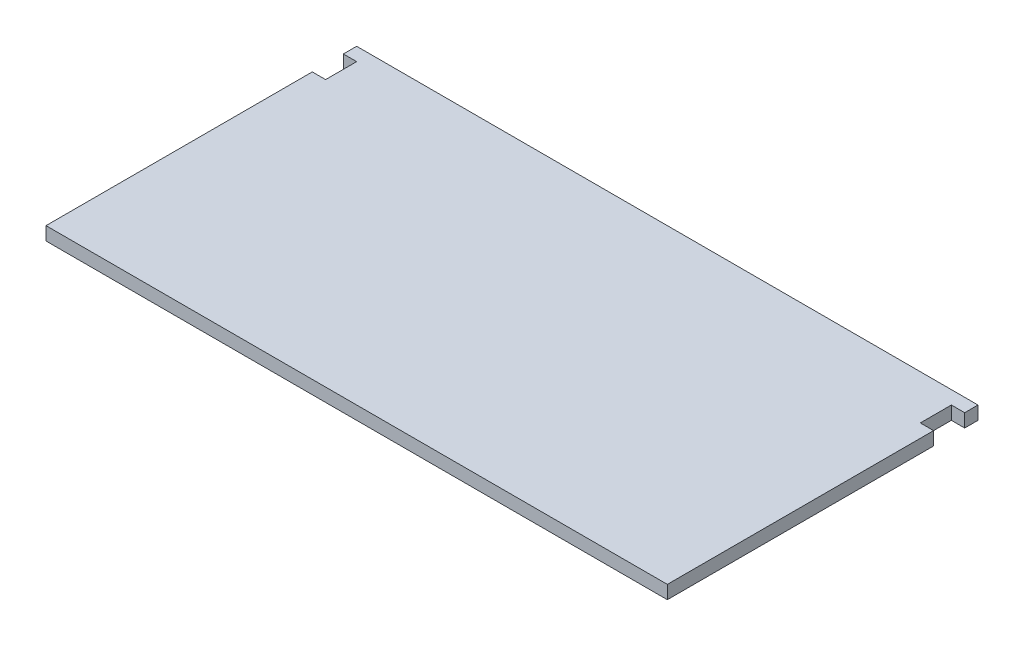
ISO-10303-21;
HEADER;
FILE_DESCRIPTION(('STEP AP214'),'2;1');
FILE_NAME('part.step','',(''),(''),'','','');
FILE_SCHEMA(('AUTOMOTIVE_DESIGN { 1 0 10303 214 1 1 1 1 }'));
ENDSEC;
DATA;
#1=APPLICATION_CONTEXT('core data for automotive mechanical design processes');
#2=APPLICATION_PROTOCOL_DEFINITION('international standard','automotive_design',2000,#1);
#3=PRODUCT_CONTEXT('',#1,'mechanical');
#4=PRODUCT('Part','Part','',(#3));
#5=PRODUCT_RELATED_PRODUCT_CATEGORY('part','',(#4));
#6=PRODUCT_DEFINITION_FORMATION('','',#4);
#7=PRODUCT_DEFINITION_CONTEXT('part definition',#1,'design');
#8=PRODUCT_DEFINITION('design','',#6,#7);
#9=PRODUCT_DEFINITION_SHAPE('','',#8);
#10=(LENGTH_UNIT() NAMED_UNIT(*) SI_UNIT(.MILLI.,.METRE.));
#11=(NAMED_UNIT(*) PLANE_ANGLE_UNIT() SI_UNIT($,.RADIAN.));
#12=(NAMED_UNIT(*) SI_UNIT($,.STERADIAN.) SOLID_ANGLE_UNIT());
#13=UNCERTAINTY_MEASURE_WITH_UNIT(LENGTH_MEASURE(1.E-05),#10,'distance_accuracy_value','');
#14=(GEOMETRIC_REPRESENTATION_CONTEXT(3) GLOBAL_UNCERTAINTY_ASSIGNED_CONTEXT((#13)) GLOBAL_UNIT_ASSIGNED_CONTEXT((#10,
#11,#12)) REPRESENTATION_CONTEXT('',''));
#15=CARTESIAN_POINT('',(0.,0.,0.));
#16=DIRECTION('',(0.,0.,1.));
#17=DIRECTION('',(1.,0.,0.));
#18=AXIS2_PLACEMENT_3D('',#15,#16,#17);
#19=CARTESIAN_POINT('',(70.,3.,35.));
#20=DIRECTION('',(-1.,0.,0.));
#21=DIRECTION('',(0.,0.,1.));
#22=AXIS2_PLACEMENT_3D('',#19,#20,#21);
#23=PLANE('',#22);
#24=DIRECTION('',(0.,0.,-1.));
#25=VECTOR('',#24,1.);
#26=CARTESIAN_POINT('',(70.,3.,35.));
#27=LINE('',#26,#25);
#28=CARTESIAN_POINT('',(70.,3.,-32.));
#29=VERTEX_POINT('',#28);
#30=CARTESIAN_POINT('',(70.,3.,-35.));
#31=VERTEX_POINT('',#30);
#32=EDGE_CURVE('E159',#29,#31,#27,.T.);
#33=ORIENTED_EDGE('',*,*,#32,.F.);
#34=DIRECTION('',(0.,1.,0.));
#35=VECTOR('',#34,1.);
#36=CARTESIAN_POINT('',(70.,0.,-32.));
#37=LINE('',#36,#35);
#38=CARTESIAN_POINT('',(70.,0.,-32.));
#39=VERTEX_POINT('',#38);
#40=EDGE_CURVE('E214',#39,#29,#37,.T.);
#41=ORIENTED_EDGE('',*,*,#40,.F.);
#42=DIRECTION('',(0.,0.,-1.));
#43=VECTOR('',#42,1.);
#44=CARTESIAN_POINT('',(70.,0.,35.));
#45=LINE('',#44,#43);
#46=CARTESIAN_POINT('',(70.,0.,-35.));
#47=VERTEX_POINT('',#46);
#48=EDGE_CURVE('E192',#39,#47,#45,.T.);
#49=ORIENTED_EDGE('',*,*,#48,.T.);
#50=DIRECTION('',(0.,-1.,0.));
#51=VECTOR('',#50,1.);
#52=CARTESIAN_POINT('',(70.,3.,-35.));
#53=LINE('',#52,#51);
#54=EDGE_CURVE('E11',#31,#47,#53,.T.);
#55=ORIENTED_EDGE('',*,*,#54,.F.);
#56=EDGE_LOOP('',(#33,#41,#49,#55));
#57=FACE_BOUND('',#56,.T.);
#58=ADVANCED_FACE('F36',(#57),#23,.F.);
#59=CARTESIAN_POINT('',(-70.,3.,35.));
#60=DIRECTION('',(1.,0.,0.));
#61=DIRECTION('',(0.,0.,-1.));
#62=AXIS2_PLACEMENT_3D('',#59,#60,#61);
#63=PLANE('',#62);
#64=DIRECTION('',(0.,0.,1.));
#65=VECTOR('',#64,1.);
#66=CARTESIAN_POINT('',(-70.,0.,35.));
#67=LINE('',#66,#65);
#68=CARTESIAN_POINT('',(-70.,0.,-35.));
#69=VERTEX_POINT('',#68);
#70=CARTESIAN_POINT('',(-70.,0.,-32.));
#71=VERTEX_POINT('',#70);
#72=EDGE_CURVE('E150',#69,#71,#67,.T.);
#73=ORIENTED_EDGE('',*,*,#72,.T.);
#74=DIRECTION('',(0.,1.,0.));
#75=VECTOR('',#74,1.);
#76=CARTESIAN_POINT('',(-70.,0.,-32.));
#77=LINE('',#76,#75);
#78=CARTESIAN_POINT('',(-70.,3.,-32.));
#79=VERTEX_POINT('',#78);
#80=EDGE_CURVE('E190',#71,#79,#77,.T.);
#81=ORIENTED_EDGE('',*,*,#80,.T.);
#82=DIRECTION('',(0.,0.,1.));
#83=VECTOR('',#82,1.);
#84=CARTESIAN_POINT('',(-70.,3.,35.));
#85=LINE('',#84,#83);
#86=CARTESIAN_POINT('',(-70.,3.,-35.));
#87=VERTEX_POINT('',#86);
#88=EDGE_CURVE('E173',#87,#79,#85,.T.);
#89=ORIENTED_EDGE('',*,*,#88,.F.);
#90=DIRECTION('',(0.,-1.,0.));
#91=VECTOR('',#90,1.);
#92=CARTESIAN_POINT('',(-70.,3.,-35.));
#93=LINE('',#92,#91);
#94=EDGE_CURVE('E44',#87,#69,#93,.T.);
#95=ORIENTED_EDGE('',*,*,#94,.T.);
#96=EDGE_LOOP('',(#73,#81,#89,#95));
#97=FACE_BOUND('',#96,.T.);
#98=ADVANCED_FACE('F170',(#97),#63,.F.);
#99=CARTESIAN_POINT('',(70.,0.,35.));
#100=VERTEX_POINT('',#99);
#101=CARTESIAN_POINT('',(70.,0.,-25.));
#102=VERTEX_POINT('',#101);
#103=EDGE_CURVE('E154',#100,#102,#45,.T.);
#104=ORIENTED_EDGE('',*,*,#103,.T.);
#105=DIRECTION('',(0.,1.,0.));
#106=VECTOR('',#105,1.);
#107=CARTESIAN_POINT('',(70.,0.,-25.));
#108=LINE('',#107,#106);
#109=CARTESIAN_POINT('',(70.,3.,-25.));
#110=VERTEX_POINT('',#109);
#111=EDGE_CURVE('E59',#102,#110,#108,.T.);
#112=ORIENTED_EDGE('',*,*,#111,.T.);
#113=CARTESIAN_POINT('',(70.,3.,35.));
#114=VERTEX_POINT('',#113);
#115=EDGE_CURVE('E218',#114,#110,#27,.T.);
#116=ORIENTED_EDGE('',*,*,#115,.F.);
#117=DIRECTION('',(0.,-1.,0.));
#118=VECTOR('',#117,1.);
#119=CARTESIAN_POINT('',(70.,3.,35.));
#120=LINE('',#119,#118);
#121=EDGE_CURVE('E160',#114,#100,#120,.T.);
#122=ORIENTED_EDGE('',*,*,#121,.T.);
#123=EDGE_LOOP('',(#104,#112,#116,#122));
#124=FACE_BOUND('',#123,.T.);
#125=ADVANCED_FACE('F38',(#124),#23,.F.);
#126=CARTESIAN_POINT('',(-70.,3.,-35.));
#127=DIRECTION('',(0.,0.,1.));
#128=DIRECTION('',(1.,0.,0.));
#129=AXIS2_PLACEMENT_3D('',#126,#127,#128);
#130=PLANE('',#129);
#131=DIRECTION('',(-1.,0.,0.));
#132=VECTOR('',#131,1.);
#133=CARTESIAN_POINT('',(-70.,0.,-35.));
#134=LINE('',#133,#132);
#135=EDGE_CURVE('E151',#47,#69,#134,.T.);
#136=ORIENTED_EDGE('',*,*,#135,.T.);
#137=ORIENTED_EDGE('',*,*,#94,.F.);
#138=DIRECTION('',(-1.,0.,0.));
#139=VECTOR('',#138,1.);
#140=CARTESIAN_POINT('',(-70.,3.,-35.));
#141=LINE('',#140,#139);
#142=EDGE_CURVE('E221',#31,#87,#141,.T.);
#143=ORIENTED_EDGE('',*,*,#142,.F.);
#144=ORIENTED_EDGE('',*,*,#54,.T.);
#145=EDGE_LOOP('',(#136,#137,#143,#144));
#146=FACE_BOUND('',#145,.T.);
#147=ADVANCED_FACE('F256',(#146),#130,.F.);
#148=CARTESIAN_POINT('',(-70.,3.,-25.));
#149=VERTEX_POINT('',#148);
#150=CARTESIAN_POINT('',(-70.,3.,35.));
#151=VERTEX_POINT('',#150);
#152=EDGE_CURVE('E142',#149,#151,#85,.T.);
#153=ORIENTED_EDGE('',*,*,#152,.F.);
#154=DIRECTION('',(0.,1.,0.));
#155=VECTOR('',#154,1.);
#156=CARTESIAN_POINT('',(-70.,0.,-25.));
#157=LINE('',#156,#155);
#158=CARTESIAN_POINT('',(-70.,0.,-25.));
#159=VERTEX_POINT('',#158);
#160=EDGE_CURVE('E129',#159,#149,#157,.T.);
#161=ORIENTED_EDGE('',*,*,#160,.F.);
#162=CARTESIAN_POINT('',(-70.,0.,35.));
#163=VERTEX_POINT('',#162);
#164=EDGE_CURVE('E140',#159,#163,#67,.T.);
#165=ORIENTED_EDGE('',*,*,#164,.T.);
#166=DIRECTION('',(0.,-1.,0.));
#167=VECTOR('',#166,1.);
#168=CARTESIAN_POINT('',(-70.,3.,35.));
#169=LINE('',#168,#167);
#170=EDGE_CURVE('E163',#151,#163,#169,.T.);
#171=ORIENTED_EDGE('',*,*,#170,.F.);
#172=EDGE_LOOP('',(#153,#161,#165,#171));
#173=FACE_BOUND('',#172,.T.);
#174=ADVANCED_FACE('F138',(#173),#63,.F.);
#175=CARTESIAN_POINT('',(-70.,3.,35.));
#176=DIRECTION('',(0.,0.,-1.));
#177=DIRECTION('',(-1.,0.,0.));
#178=AXIS2_PLACEMENT_3D('',#175,#176,#177);
#179=PLANE('',#178);
#180=DIRECTION('',(1.,0.,0.));
#181=VECTOR('',#180,1.);
#182=CARTESIAN_POINT('',(-70.,0.,35.));
#183=LINE('',#182,#181);
#184=EDGE_CURVE('E149',#163,#100,#183,.T.);
#185=ORIENTED_EDGE('',*,*,#184,.T.);
#186=ORIENTED_EDGE('',*,*,#121,.F.);
#187=DIRECTION('',(1.,0.,0.));
#188=VECTOR('',#187,1.);
#189=CARTESIAN_POINT('',(-70.,3.,35.));
#190=LINE('',#189,#188);
#191=EDGE_CURVE('E164',#151,#114,#190,.T.);
#192=ORIENTED_EDGE('',*,*,#191,.F.);
#193=ORIENTED_EDGE('',*,*,#170,.T.);
#194=EDGE_LOOP('',(#185,#186,#192,#193));
#195=FACE_BOUND('',#194,.T.);
#196=ADVANCED_FACE('F263',(#195),#179,.F.);
#197=CARTESIAN_POINT('',(0.,3.,0.));
#198=DIRECTION('',(0.,-1.,0.));
#199=DIRECTION('',(0.,0.,-1.));
#200=AXIS2_PLACEMENT_3D('',#197,#198,#199);
#201=PLANE('',#200);
#202=ORIENTED_EDGE('',*,*,#88,.T.);
#203=DIRECTION('',(-1.,0.,0.));
#204=VECTOR('',#203,1.);
#205=CARTESIAN_POINT('',(-70.,3.,-32.));
#206=LINE('',#205,#204);
#207=CARTESIAN_POINT('',(-67.,3.,-32.));
#208=VERTEX_POINT('',#207);
#209=EDGE_CURVE('E134',#208,#79,#206,.T.);
#210=ORIENTED_EDGE('',*,*,#209,.F.);
#211=DIRECTION('',(0.,0.,-1.));
#212=VECTOR('',#211,1.);
#213=CARTESIAN_POINT('',(-67.,3.,-32.));
#214=LINE('',#213,#212);
#215=CARTESIAN_POINT('',(-67.,3.,-25.));
#216=VERTEX_POINT('',#215);
#217=EDGE_CURVE('E185',#216,#208,#214,.T.);
#218=ORIENTED_EDGE('',*,*,#217,.F.);
#219=DIRECTION('',(1.,0.,0.));
#220=VECTOR('',#219,1.);
#221=CARTESIAN_POINT('',(-67.,3.,-25.));
#222=LINE('',#221,#220);
#223=EDGE_CURVE('E183',#149,#216,#222,.T.);
#224=ORIENTED_EDGE('',*,*,#223,.F.);
#225=ORIENTED_EDGE('',*,*,#152,.T.);
#226=ORIENTED_EDGE('',*,*,#191,.T.);
#227=ORIENTED_EDGE('',*,*,#115,.T.);
#228=DIRECTION('',(1.,0.,0.));
#229=VECTOR('',#228,1.);
#230=CARTESIAN_POINT('',(67.,3.,-25.));
#231=LINE('',#230,#229);
#232=CARTESIAN_POINT('',(67.,3.,-25.));
#233=VERTEX_POINT('',#232);
#234=EDGE_CURVE('E209',#233,#110,#231,.T.);
#235=ORIENTED_EDGE('',*,*,#234,.F.);
#236=DIRECTION('',(0.,0.,1.));
#237=VECTOR('',#236,1.);
#238=CARTESIAN_POINT('',(67.,3.,-32.));
#239=LINE('',#238,#237);
#240=CARTESIAN_POINT('',(67.,3.,-32.));
#241=VERTEX_POINT('',#240);
#242=EDGE_CURVE('E206',#241,#233,#239,.T.);
#243=ORIENTED_EDGE('',*,*,#242,.F.);
#244=DIRECTION('',(-1.,0.,0.));
#245=VECTOR('',#244,1.);
#246=CARTESIAN_POINT('',(70.,3.,-32.));
#247=LINE('',#246,#245);
#248=EDGE_CURVE('E200',#29,#241,#247,.T.);
#249=ORIENTED_EDGE('',*,*,#248,.F.);
#250=ORIENTED_EDGE('',*,*,#32,.T.);
#251=ORIENTED_EDGE('',*,*,#142,.T.);
#252=EDGE_LOOP('',(#202,#210,#218,#224,#225,#226,#227,#235,#243,#249,#250,#251));
#253=FACE_BOUND('',#252,.T.);
#254=ADVANCED_FACE('F267',(#253),#201,.F.);
#255=CARTESIAN_POINT('',(0.,0.,0.));
#256=DIRECTION('',(0.,-1.,0.));
#257=DIRECTION('',(0.,0.,-1.));
#258=AXIS2_PLACEMENT_3D('',#255,#256,#257);
#259=PLANE('',#258);
#260=DIRECTION('',(-1.,0.,0.));
#261=VECTOR('',#260,1.);
#262=CARTESIAN_POINT('',(-70.,0.,-32.));
#263=LINE('',#262,#261);
#264=CARTESIAN_POINT('',(-67.,0.,-32.));
#265=VERTEX_POINT('',#264);
#266=EDGE_CURVE('E143',#265,#71,#263,.T.);
#267=ORIENTED_EDGE('',*,*,#266,.T.);
#268=ORIENTED_EDGE('',*,*,#72,.F.);
#269=ORIENTED_EDGE('',*,*,#135,.F.);
#270=ORIENTED_EDGE('',*,*,#48,.F.);
#271=DIRECTION('',(-1.,0.,0.));
#272=VECTOR('',#271,1.);
#273=CARTESIAN_POINT('',(70.,0.,-32.));
#274=LINE('',#273,#272);
#275=CARTESIAN_POINT('',(67.,0.,-32.));
#276=VERTEX_POINT('',#275);
#277=EDGE_CURVE('E202',#39,#276,#274,.T.);
#278=ORIENTED_EDGE('',*,*,#277,.T.);
#279=DIRECTION('',(0.,0.,1.));
#280=VECTOR('',#279,1.);
#281=CARTESIAN_POINT('',(67.,0.,-32.));
#282=LINE('',#281,#280);
#283=CARTESIAN_POINT('',(67.,0.,-25.));
#284=VERTEX_POINT('',#283);
#285=EDGE_CURVE('E196',#276,#284,#282,.T.);
#286=ORIENTED_EDGE('',*,*,#285,.T.);
#287=DIRECTION('',(1.,0.,0.));
#288=VECTOR('',#287,1.);
#289=CARTESIAN_POINT('',(67.,0.,-25.));
#290=LINE('',#289,#288);
#291=EDGE_CURVE('E199',#284,#102,#290,.T.);
#292=ORIENTED_EDGE('',*,*,#291,.T.);
#293=ORIENTED_EDGE('',*,*,#103,.F.);
#294=ORIENTED_EDGE('',*,*,#184,.F.);
#295=ORIENTED_EDGE('',*,*,#164,.F.);
#296=DIRECTION('',(1.,0.,0.));
#297=VECTOR('',#296,1.);
#298=CARTESIAN_POINT('',(-67.,0.,-25.));
#299=LINE('',#298,#297);
#300=CARTESIAN_POINT('',(-67.,0.,-25.));
#301=VERTEX_POINT('',#300);
#302=EDGE_CURVE('E125',#159,#301,#299,.T.);
#303=ORIENTED_EDGE('',*,*,#302,.T.);
#304=DIRECTION('',(0.,0.,-1.));
#305=VECTOR('',#304,1.);
#306=CARTESIAN_POINT('',(-67.,0.,-32.));
#307=LINE('',#306,#305);
#308=EDGE_CURVE('E51',#301,#265,#307,.T.);
#309=ORIENTED_EDGE('',*,*,#308,.T.);
#310=EDGE_LOOP('',(#267,#268,#269,#270,#278,#286,#292,#293,#294,#295,#303,#309));
#311=FACE_BOUND('',#310,.T.);
#312=ADVANCED_FACE('F147',(#311),#259,.T.);
#313=CARTESIAN_POINT('',(67.,0.,-32.));
#314=DIRECTION('',(-1.,0.,0.));
#315=DIRECTION('',(0.,0.,1.));
#316=AXIS2_PLACEMENT_3D('',#313,#314,#315);
#317=PLANE('',#316);
#318=ORIENTED_EDGE('',*,*,#242,.T.);
#319=DIRECTION('',(0.,1.,0.));
#320=VECTOR('',#319,1.);
#321=CARTESIAN_POINT('',(67.,0.,-25.));
#322=LINE('',#321,#320);
#323=EDGE_CURVE('E205',#284,#233,#322,.T.);
#324=ORIENTED_EDGE('',*,*,#323,.F.);
#325=ORIENTED_EDGE('',*,*,#285,.F.);
#326=DIRECTION('',(0.,1.,0.));
#327=VECTOR('',#326,1.);
#328=CARTESIAN_POINT('',(67.,0.,-32.));
#329=LINE('',#328,#327);
#330=EDGE_CURVE('E186',#276,#241,#329,.T.);
#331=ORIENTED_EDGE('',*,*,#330,.T.);
#332=EDGE_LOOP('',(#318,#324,#325,#331));
#333=FACE_BOUND('',#332,.T.);
#334=ADVANCED_FACE('F236',(#333),#317,.F.);
#335=CARTESIAN_POINT('',(70.,0.,-32.));
#336=DIRECTION('',(0.,0.,-1.));
#337=DIRECTION('',(-1.,0.,0.));
#338=AXIS2_PLACEMENT_3D('',#335,#336,#337);
#339=PLANE('',#338);
#340=ORIENTED_EDGE('',*,*,#248,.T.);
#341=ORIENTED_EDGE('',*,*,#330,.F.);
#342=ORIENTED_EDGE('',*,*,#277,.F.);
#343=ORIENTED_EDGE('',*,*,#40,.T.);
#344=EDGE_LOOP('',(#340,#341,#342,#343));
#345=FACE_BOUND('',#344,.T.);
#346=ADVANCED_FACE('F232',(#345),#339,.F.);
#347=CARTESIAN_POINT('',(67.,0.,-25.));
#348=DIRECTION('',(0.,0.,1.));
#349=DIRECTION('',(1.,0.,0.));
#350=AXIS2_PLACEMENT_3D('',#347,#348,#349);
#351=PLANE('',#350);
#352=ORIENTED_EDGE('',*,*,#234,.T.);
#353=ORIENTED_EDGE('',*,*,#111,.F.);
#354=ORIENTED_EDGE('',*,*,#291,.F.);
#355=ORIENTED_EDGE('',*,*,#323,.T.);
#356=EDGE_LOOP('',(#352,#353,#354,#355));
#357=FACE_BOUND('',#356,.T.);
#358=ADVANCED_FACE('F238',(#357),#351,.F.);
#359=CARTESIAN_POINT('',(-70.,0.,-32.));
#360=DIRECTION('',(0.,0.,-1.));
#361=DIRECTION('',(-1.,0.,0.));
#362=AXIS2_PLACEMENT_3D('',#359,#360,#361);
#363=PLANE('',#362);
#364=ORIENTED_EDGE('',*,*,#209,.T.);
#365=ORIENTED_EDGE('',*,*,#80,.F.);
#366=ORIENTED_EDGE('',*,*,#266,.F.);
#367=DIRECTION('',(0.,1.,0.));
#368=VECTOR('',#367,1.);
#369=CARTESIAN_POINT('',(-67.,0.,-32.));
#370=LINE('',#369,#368);
#371=EDGE_CURVE('E193',#265,#208,#370,.T.);
#372=ORIENTED_EDGE('',*,*,#371,.T.);
#373=EDGE_LOOP('',(#364,#365,#366,#372));
#374=FACE_BOUND('',#373,.T.);
#375=ADVANCED_FACE('F240',(#374),#363,.F.);
#376=CARTESIAN_POINT('',(-67.,0.,-32.));
#377=DIRECTION('',(1.,0.,0.));
#378=DIRECTION('',(0.,0.,-1.));
#379=AXIS2_PLACEMENT_3D('',#376,#377,#378);
#380=PLANE('',#379);
#381=ORIENTED_EDGE('',*,*,#217,.T.);
#382=ORIENTED_EDGE('',*,*,#371,.F.);
#383=ORIENTED_EDGE('',*,*,#308,.F.);
#384=DIRECTION('',(0.,1.,0.));
#385=VECTOR('',#384,1.);
#386=CARTESIAN_POINT('',(-67.,0.,-25.));
#387=LINE('',#386,#385);
#388=EDGE_CURVE('E131',#301,#216,#387,.T.);
#389=ORIENTED_EDGE('',*,*,#388,.T.);
#390=EDGE_LOOP('',(#381,#382,#383,#389));
#391=FACE_BOUND('',#390,.T.);
#392=ADVANCED_FACE('F246',(#391),#380,.F.);
#393=CARTESIAN_POINT('',(-67.,0.,-25.));
#394=DIRECTION('',(0.,0.,1.));
#395=DIRECTION('',(1.,0.,0.));
#396=AXIS2_PLACEMENT_3D('',#393,#394,#395);
#397=PLANE('',#396);
#398=ORIENTED_EDGE('',*,*,#223,.T.);
#399=ORIENTED_EDGE('',*,*,#388,.F.);
#400=ORIENTED_EDGE('',*,*,#302,.F.);
#401=ORIENTED_EDGE('',*,*,#160,.T.);
#402=EDGE_LOOP('',(#398,#399,#400,#401));
#403=FACE_BOUND('',#402,.T.);
#404=ADVANCED_FACE('F128',(#403),#397,.F.);
#405=CLOSED_SHELL('',(#58,#98,#125,#147,#174,#196,#254,#312,#334,#346,#358,#375,#392,#404));
#406=MANIFOLD_SOLID_BREP('B2',#405);
#407=ADVANCED_BREP_SHAPE_REPRESENTATION('',(#18,#406),#14);
#408=SHAPE_DEFINITION_REPRESENTATION(#9,#407);
ENDSEC;
END-ISO-10303-21;
